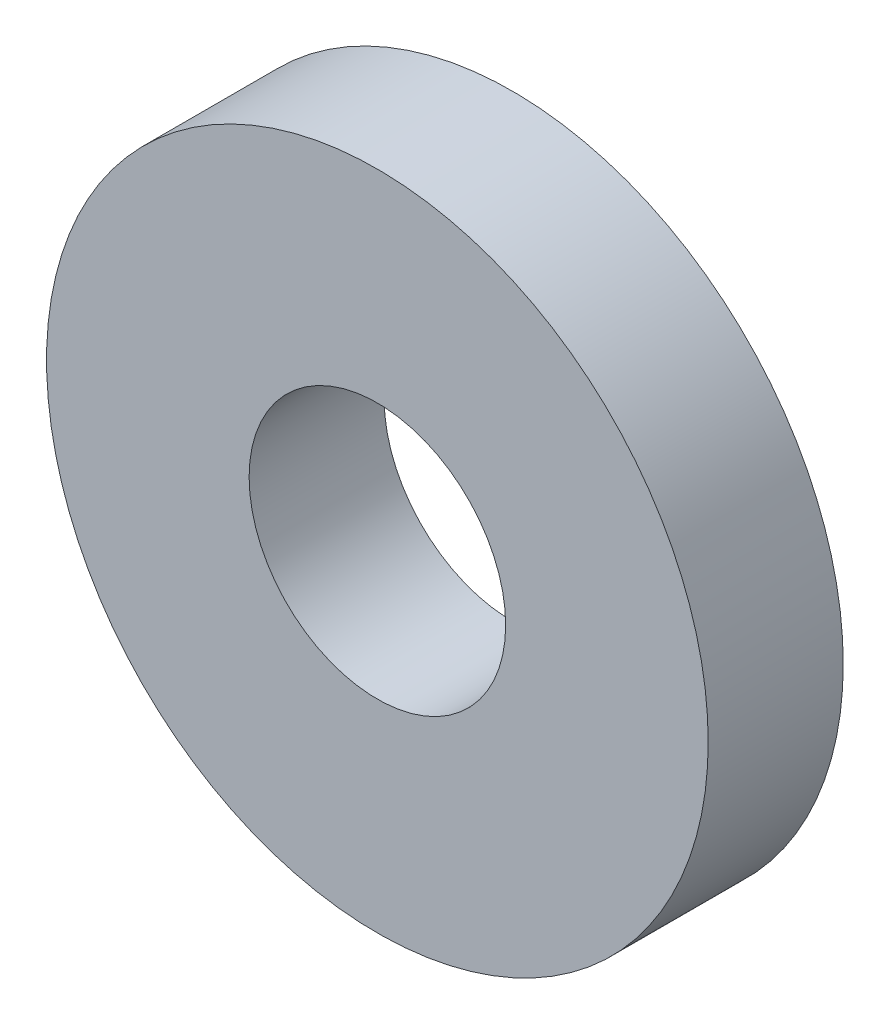
ISO-10303-21;
HEADER;
FILE_DESCRIPTION(('STEP AP214'),'2;1');
FILE_NAME('part.step','',(''),(''),'','','');
FILE_SCHEMA(('AUTOMOTIVE_DESIGN { 1 0 10303 214 1 1 1 1 }'));
ENDSEC;
DATA;
#1=APPLICATION_CONTEXT('core data for automotive mechanical design processes');
#2=APPLICATION_PROTOCOL_DEFINITION('international standard','automotive_design',2000,#1);
#3=PRODUCT_CONTEXT('',#1,'mechanical');
#4=PRODUCT('Part','Part','',(#3));
#5=PRODUCT_RELATED_PRODUCT_CATEGORY('part','',(#4));
#6=PRODUCT_DEFINITION_FORMATION('','',#4);
#7=PRODUCT_DEFINITION_CONTEXT('part definition',#1,'design');
#8=PRODUCT_DEFINITION('design','',#6,#7);
#9=PRODUCT_DEFINITION_SHAPE('','',#8);
#10=(LENGTH_UNIT() NAMED_UNIT(*) SI_UNIT(.MILLI.,.METRE.));
#11=(NAMED_UNIT(*) PLANE_ANGLE_UNIT() SI_UNIT($,.RADIAN.));
#12=(NAMED_UNIT(*) SI_UNIT($,.STERADIAN.) SOLID_ANGLE_UNIT());
#13=UNCERTAINTY_MEASURE_WITH_UNIT(LENGTH_MEASURE(1.E-05),#10,'distance_accuracy_value','');
#14=(GEOMETRIC_REPRESENTATION_CONTEXT(3) GLOBAL_UNCERTAINTY_ASSIGNED_CONTEXT((#13)) GLOBAL_UNIT_ASSIGNED_CONTEXT((#10,
#11,#12)) REPRESENTATION_CONTEXT('',''));
#15=CARTESIAN_POINT('',(0.,0.,0.));
#16=DIRECTION('',(0.,0.,1.));
#17=DIRECTION('',(1.,0.,0.));
#18=AXIS2_PLACEMENT_3D('',#15,#16,#17);
#19=CARTESIAN_POINT('',(0.,0.,1.));
#20=DIRECTION('',(0.,0.,1.));
#21=DIRECTION('',(1.,0.,0.));
#22=AXIS2_PLACEMENT_3D('',#19,#20,#21);
#23=PLANE('',#22);
#24=CARTESIAN_POINT('',(0.,0.,1.));
#25=DIRECTION('',(0.,0.,1.));
#26=DIRECTION('',(1.,0.,0.));
#27=AXIS2_PLACEMENT_3D('',#24,#25,#26);
#28=CIRCLE('',#27,2.45);
#29=CARTESIAN_POINT('',(2.45,0.,1.));
#30=VERTEX_POINT('',#29);
#31=EDGE_CURVE('E10',#30,#30,#28,.T.);
#32=ORIENTED_EDGE('',*,*,#31,.T.);
#33=EDGE_LOOP('',(#32));
#34=FACE_BOUND('',#33,.T.);
#35=CARTESIAN_POINT('',(0.,0.,1.));
#36=DIRECTION('',(0.,0.,1.));
#37=DIRECTION('',(1.,0.,0.));
#38=AXIS2_PLACEMENT_3D('',#35,#36,#37);
#39=CIRCLE('',#38,0.95);
#40=CARTESIAN_POINT('',(0.95,0.,1.));
#41=VERTEX_POINT('',#40);
#42=EDGE_CURVE('E42',#41,#41,#39,.T.);
#43=ORIENTED_EDGE('',*,*,#42,.F.);
#44=EDGE_LOOP('',(#43));
#45=FACE_BOUND('',#44,.T.);
#46=ADVANCED_FACE('F31',(#34,#45),#23,.T.);
#47=CARTESIAN_POINT('',(0.,0.,0.));
#48=DIRECTION('',(0.,0.,1.));
#49=DIRECTION('',(1.,0.,0.));
#50=AXIS2_PLACEMENT_3D('',#47,#48,#49);
#51=PLANE('',#50);
#52=CARTESIAN_POINT('',(0.,0.,0.));
#53=DIRECTION('',(0.,0.,1.));
#54=DIRECTION('',(1.,0.,0.));
#55=AXIS2_PLACEMENT_3D('',#52,#53,#54);
#56=CIRCLE('',#55,2.45);
#57=CARTESIAN_POINT('',(2.45,0.,0.));
#58=VERTEX_POINT('',#57);
#59=EDGE_CURVE('E35',#58,#58,#56,.T.);
#60=ORIENTED_EDGE('',*,*,#59,.F.);
#61=EDGE_LOOP('',(#60));
#62=FACE_BOUND('',#61,.T.);
#63=CARTESIAN_POINT('',(0.,0.,0.));
#64=DIRECTION('',(0.,0.,1.));
#65=DIRECTION('',(1.,0.,0.));
#66=AXIS2_PLACEMENT_3D('',#63,#64,#65);
#67=CIRCLE('',#66,0.95);
#68=CARTESIAN_POINT('',(0.95,0.,0.));
#69=VERTEX_POINT('',#68);
#70=EDGE_CURVE('E44',#69,#69,#67,.T.);
#71=ORIENTED_EDGE('',*,*,#70,.T.);
#72=EDGE_LOOP('',(#71));
#73=FACE_BOUND('',#72,.T.);
#74=ADVANCED_FACE('F54',(#62,#73),#51,.F.);
#75=CARTESIAN_POINT('',(0.,0.,1.));
#76=DIRECTION('',(0.,0.,-1.));
#77=DIRECTION('',(-1.,0.,0.));
#78=AXIS2_PLACEMENT_3D('',#75,#76,#77);
#79=CYLINDRICAL_SURFACE('',#78,2.45);
#80=ORIENTED_EDGE('',*,*,#31,.F.);
#81=EDGE_LOOP('',(#80));
#82=FACE_BOUND('',#81,.T.);
#83=ORIENTED_EDGE('',*,*,#59,.T.);
#84=EDGE_LOOP('',(#83));
#85=FACE_BOUND('',#84,.T.);
#86=ADVANCED_FACE('F33',(#82,#85),#79,.T.);
#87=CARTESIAN_POINT('',(0.,0.,1.));
#88=DIRECTION('',(0.,0.,-1.));
#89=DIRECTION('',(-1.,0.,0.));
#90=AXIS2_PLACEMENT_3D('',#87,#88,#89);
#91=CYLINDRICAL_SURFACE('',#90,0.95);
#92=ORIENTED_EDGE('',*,*,#42,.T.);
#93=EDGE_LOOP('',(#92));
#94=FACE_BOUND('',#93,.T.);
#95=ORIENTED_EDGE('',*,*,#70,.F.);
#96=EDGE_LOOP('',(#95));
#97=FACE_BOUND('',#96,.T.);
#98=ADVANCED_FACE('F50',(#94,#97),#91,.F.);
#99=CLOSED_SHELL('',(#46,#74,#86,#98));
#100=MANIFOLD_SOLID_BREP('B2',#99);
#101=ADVANCED_BREP_SHAPE_REPRESENTATION('',(#18,#100),#14);
#102=SHAPE_DEFINITION_REPRESENTATION(#9,#101);
ENDSEC;
END-ISO-10303-21;
